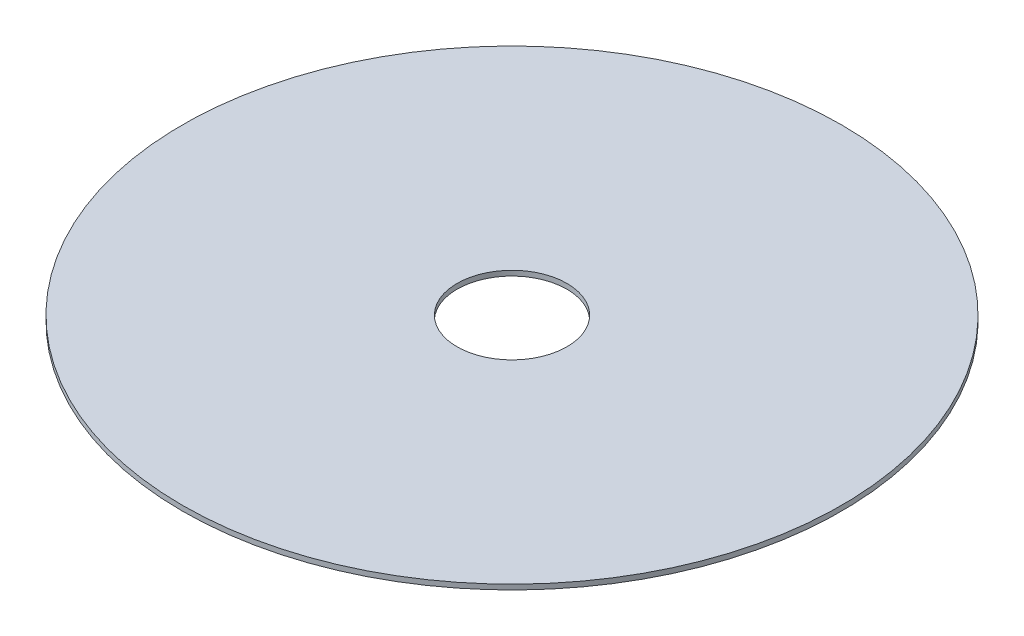
ISO-10303-21;
HEADER;
FILE_DESCRIPTION(('STEP AP214'),'2;1');
FILE_NAME('part.step','',(''),(''),'','','');
FILE_SCHEMA(('AUTOMOTIVE_DESIGN { 1 0 10303 214 1 1 1 1 }'));
ENDSEC;
DATA;
#1=APPLICATION_CONTEXT('core data for automotive mechanical design processes');
#2=APPLICATION_PROTOCOL_DEFINITION('international standard','automotive_design',2000,#1);
#3=PRODUCT_CONTEXT('',#1,'mechanical');
#4=PRODUCT('Part','Part','',(#3));
#5=PRODUCT_RELATED_PRODUCT_CATEGORY('part','',(#4));
#6=PRODUCT_DEFINITION_FORMATION('','',#4);
#7=PRODUCT_DEFINITION_CONTEXT('part definition',#1,'design');
#8=PRODUCT_DEFINITION('design','',#6,#7);
#9=PRODUCT_DEFINITION_SHAPE('','',#8);
#10=(LENGTH_UNIT() NAMED_UNIT(*) SI_UNIT(.MILLI.,.METRE.));
#11=(NAMED_UNIT(*) PLANE_ANGLE_UNIT() SI_UNIT($,.RADIAN.));
#12=(NAMED_UNIT(*) SI_UNIT($,.STERADIAN.) SOLID_ANGLE_UNIT());
#13=UNCERTAINTY_MEASURE_WITH_UNIT(LENGTH_MEASURE(1.E-05),#10,'distance_accuracy_value','');
#14=(GEOMETRIC_REPRESENTATION_CONTEXT(3) GLOBAL_UNCERTAINTY_ASSIGNED_CONTEXT((#13)) GLOBAL_UNIT_ASSIGNED_CONTEXT((#10,
#11,#12)) REPRESENTATION_CONTEXT('',''));
#15=CARTESIAN_POINT('',(0.,0.,0.));
#16=DIRECTION('',(0.,0.,1.));
#17=DIRECTION('',(1.,0.,0.));
#18=AXIS2_PLACEMENT_3D('',#15,#16,#17);
#19=CARTESIAN_POINT('',(0.,0.,0.));
#20=DIRECTION('',(0.,-1.,0.));
#21=DIRECTION('',(0.,0.,-1.));
#22=AXIS2_PLACEMENT_3D('',#19,#20,#21);
#23=CYLINDRICAL_SURFACE('',#22,1500.);
#24=CARTESIAN_POINT('',(0.,-11.4999999999992,0.));
#25=DIRECTION('',(0.,-1.,0.));
#26=DIRECTION('',(0.,0.,-1.));
#27=AXIS2_PLACEMENT_3D('',#24,#25,#26);
#28=CIRCLE('',#27,1500.);
#29=CARTESIAN_POINT('',(0.,-11.4999999999992,-1500.));
#30=VERTEX_POINT('',#29);
#31=EDGE_CURVE('E10',#30,#30,#28,.T.);
#32=ORIENTED_EDGE('',*,*,#31,.F.);
#33=EDGE_LOOP('',(#32));
#34=FACE_BOUND('',#33,.T.);
#35=CARTESIAN_POINT('',(0.,11.5,0.));
#36=DIRECTION('',(0.,-1.,0.));
#37=DIRECTION('',(0.,0.,-1.));
#38=AXIS2_PLACEMENT_3D('',#35,#36,#37);
#39=CIRCLE('',#38,1500.);
#40=CARTESIAN_POINT('',(0.,11.5,-1500.));
#41=VERTEX_POINT('',#40);
#42=EDGE_CURVE('E62',#41,#41,#39,.T.);
#43=ORIENTED_EDGE('',*,*,#42,.T.);
#44=EDGE_LOOP('',(#43));
#45=FACE_BOUND('',#44,.T.);
#46=ADVANCED_FACE('F45',(#34,#45),#23,.T.);
#47=CARTESIAN_POINT('',(1500.,-11.4999999999996,0.));
#48=DIRECTION('',(0.,1.,0.));
#49=DIRECTION('',(0.,0.,1.));
#50=AXIS2_PLACEMENT_3D('',#47,#48,#49);
#51=PLANE('',#50);
#52=CARTESIAN_POINT('',(0.,-11.5,0.));
#53=DIRECTION('',(0.,-1.,0.));
#54=DIRECTION('',(0.,0.,-1.));
#55=AXIS2_PLACEMENT_3D('',#52,#53,#54);
#56=CIRCLE('',#55,250.);
#57=CARTESIAN_POINT('',(0.,-11.5,-250.));
#58=VERTEX_POINT('',#57);
#59=EDGE_CURVE('E52',#58,#58,#56,.T.);
#60=ORIENTED_EDGE('',*,*,#59,.F.);
#61=EDGE_LOOP('',(#60));
#62=FACE_BOUND('',#61,.T.);
#63=ORIENTED_EDGE('',*,*,#31,.T.);
#64=EDGE_LOOP('',(#63));
#65=FACE_BOUND('',#64,.T.);
#66=ADVANCED_FACE('F78',(#62,#65),#51,.F.);
#67=CARTESIAN_POINT('',(0.,0.,0.));
#68=DIRECTION('',(0.,-1.,0.));
#69=DIRECTION('',(0.,0.,-1.));
#70=AXIS2_PLACEMENT_3D('',#67,#68,#69);
#71=CYLINDRICAL_SURFACE('',#70,250.);
#72=ORIENTED_EDGE('',*,*,#59,.T.);
#73=EDGE_LOOP('',(#72));
#74=FACE_BOUND('',#73,.T.);
#75=CARTESIAN_POINT('',(0.,11.5,0.));
#76=DIRECTION('',(0.,-1.,0.));
#77=DIRECTION('',(0.,0.,-1.));
#78=AXIS2_PLACEMENT_3D('',#75,#76,#77);
#79=CIRCLE('',#78,250.);
#80=CARTESIAN_POINT('',(0.,11.5,-250.));
#81=VERTEX_POINT('',#80);
#82=EDGE_CURVE('E57',#81,#81,#79,.T.);
#83=ORIENTED_EDGE('',*,*,#82,.F.);
#84=EDGE_LOOP('',(#83));
#85=FACE_BOUND('',#84,.T.);
#86=ADVANCED_FACE('F73',(#74,#85),#71,.F.);
#87=CARTESIAN_POINT('',(250.,11.5,0.));
#88=DIRECTION('',(0.,-1.,0.));
#89=DIRECTION('',(0.,0.,-1.));
#90=AXIS2_PLACEMENT_3D('',#87,#88,#89);
#91=PLANE('',#90);
#92=ORIENTED_EDGE('',*,*,#42,.F.);
#93=EDGE_LOOP('',(#92));
#94=FACE_BOUND('',#93,.T.);
#95=ORIENTED_EDGE('',*,*,#82,.T.);
#96=EDGE_LOOP('',(#95));
#97=FACE_BOUND('',#96,.T.);
#98=ADVANCED_FACE('F70',(#94,#97),#91,.F.);
#99=CLOSED_SHELL('',(#46,#66,#86,#98));
#100=MANIFOLD_SOLID_BREP('B2',#99);
#101=ADVANCED_BREP_SHAPE_REPRESENTATION('',(#18,#100),#14);
#102=SHAPE_DEFINITION_REPRESENTATION(#9,#101);
ENDSEC;
END-ISO-10303-21;
